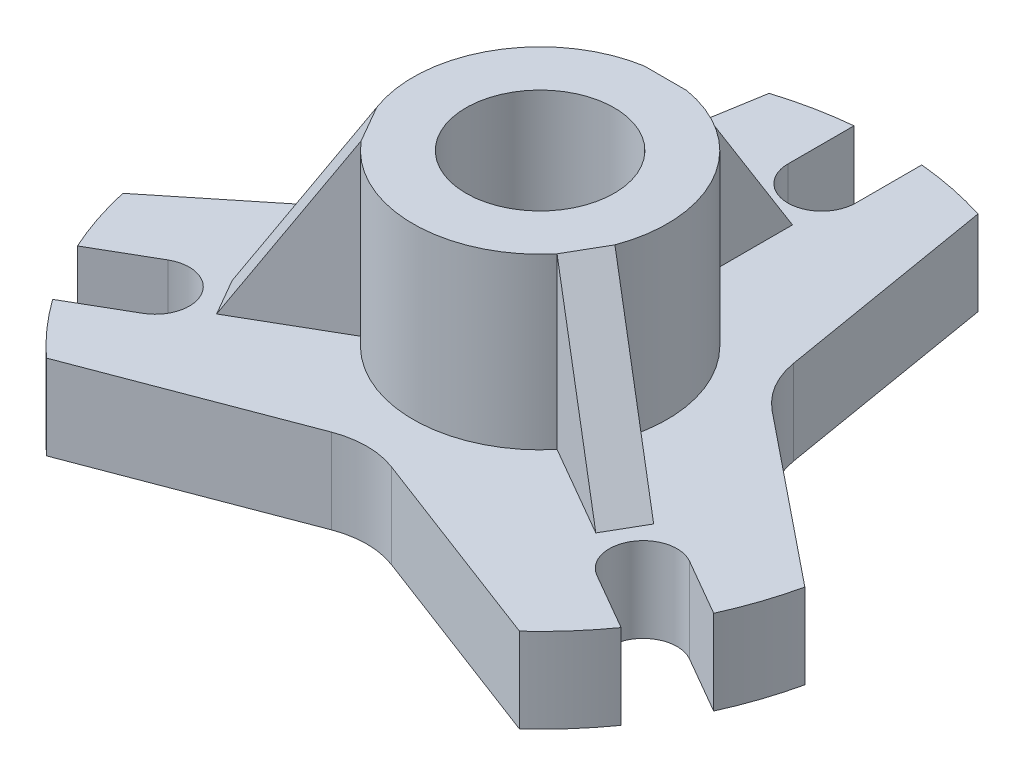
ISO-10303-21;
HEADER;
FILE_DESCRIPTION(('STEP AP214'),'2;1');
FILE_NAME('part.step','',(''),(''),'','','');
FILE_SCHEMA(('AUTOMOTIVE_DESIGN { 1 0 10303 214 1 1 1 1 }'));
ENDSEC;
DATA;
#1=APPLICATION_CONTEXT('core data for automotive mechanical design processes');
#2=APPLICATION_PROTOCOL_DEFINITION('international standard','automotive_design',2000,#1);
#3=PRODUCT_CONTEXT('',#1,'mechanical');
#4=PRODUCT('Part','Part','',(#3));
#5=PRODUCT_RELATED_PRODUCT_CATEGORY('part','',(#4));
#6=PRODUCT_DEFINITION_FORMATION('','',#4);
#7=PRODUCT_DEFINITION_CONTEXT('part definition',#1,'design');
#8=PRODUCT_DEFINITION('design','',#6,#7);
#9=PRODUCT_DEFINITION_SHAPE('','',#8);
#10=(LENGTH_UNIT() NAMED_UNIT(*) SI_UNIT(.MILLI.,.METRE.));
#11=(NAMED_UNIT(*) PLANE_ANGLE_UNIT() SI_UNIT($,.RADIAN.));
#12=(NAMED_UNIT(*) SI_UNIT($,.STERADIAN.) SOLID_ANGLE_UNIT());
#13=UNCERTAINTY_MEASURE_WITH_UNIT(LENGTH_MEASURE(1.E-05),#10,'distance_accuracy_value','');
#14=(GEOMETRIC_REPRESENTATION_CONTEXT(3) GLOBAL_UNCERTAINTY_ASSIGNED_CONTEXT((#13)) GLOBAL_UNIT_ASSIGNED_CONTEXT((#10,
#11,#12)) REPRESENTATION_CONTEXT('',''));
#15=CARTESIAN_POINT('',(0.,0.,0.));
#16=DIRECTION('',(0.,0.,1.));
#17=DIRECTION('',(1.,0.,0.));
#18=AXIS2_PLACEMENT_3D('',#15,#16,#17);
#19=CARTESIAN_POINT('',(0.,20.,0.));
#20=DIRECTION('',(0.,-1.,0.));
#21=DIRECTION('',(0.,0.,-1.));
#22=AXIS2_PLACEMENT_3D('',#19,#20,#21);
#23=CYLINDRICAL_SURFACE('',#22,82.5);
#24=CARTESIAN_POINT('',(0.,0.,0.));
#25=DIRECTION('',(0.,1.,0.));
#26=DIRECTION('',(0.,0.,1.));
#27=AXIS2_PLACEMENT_3D('',#24,#25,#26);
#28=CIRCLE('',#27,82.5);
#29=CARTESIAN_POINT('',(-67.1103895362694,0.,47.9838057712202));
#30=VERTEX_POINT('',#29);
#31=CARTESIAN_POINT('',(-55.8506507132066,0.,60.7202998585432));
#32=VERTEX_POINT('',#31);
#33=EDGE_CURVE('E278',#30,#32,#28,.T.);
#34=ORIENTED_EDGE('',*,*,#33,.T.);
#35=DIRECTION('',(0.,1.,0.));
#36=VECTOR('',#35,1.);
#37=CARTESIAN_POINT('',(-55.8506507132066,0.,60.7202998585432));
#38=LINE('',#37,#36);
#39=CARTESIAN_POINT('',(-55.8506507132066,20.,60.7202998585432));
#40=VERTEX_POINT('',#39);
#41=EDGE_CURVE('E344',#32,#40,#38,.T.);
#42=ORIENTED_EDGE('',*,*,#41,.T.);
#43=CARTESIAN_POINT('',(0.,20.,0.));
#44=DIRECTION('',(0.,1.,0.));
#45=DIRECTION('',(0.,0.,1.));
#46=AXIS2_PLACEMENT_3D('',#43,#44,#45);
#47=CIRCLE('',#46,82.5);
#48=CARTESIAN_POINT('',(-67.1103895362694,20.,47.9838057712202));
#49=VERTEX_POINT('',#48);
#50=EDGE_CURVE('E319',#49,#40,#47,.T.);
#51=ORIENTED_EDGE('',*,*,#50,.F.);
#52=DIRECTION('',(0.,1.,0.));
#53=VECTOR('',#52,1.);
#54=CARTESIAN_POINT('',(-67.1103895362694,0.,47.9838057712202));
#55=LINE('',#54,#53);
#56=EDGE_CURVE('E341',#30,#49,#55,.T.);
#57=ORIENTED_EDGE('',*,*,#56,.F.);
#58=EDGE_LOOP('',(#34,#42,#51,#57));
#59=FACE_BOUND('',#58,.T.);
#60=ADVANCED_FACE('F36',(#59),#23,.T.);
#61=CARTESIAN_POINT('',(75.1103895362699,0.,34.1273993106682));
#62=VERTEX_POINT('',#61);
#63=CARTESIAN_POINT('',(80.5104687658674,0.,18.0087317460251));
#64=VERTEX_POINT('',#63);
#65=EDGE_CURVE('E272',#62,#64,#28,.T.);
#66=ORIENTED_EDGE('',*,*,#65,.T.);
#67=DIRECTION('',(0.,1.,0.));
#68=VECTOR('',#67,1.);
#69=CARTESIAN_POINT('',(80.5104687658674,0.,18.0087317460251));
#70=LINE('',#69,#68);
#71=CARTESIAN_POINT('',(80.5104687658674,20.,18.0087317460251));
#72=VERTEX_POINT('',#71);
#73=EDGE_CURVE('E264',#64,#72,#70,.T.);
#74=ORIENTED_EDGE('',*,*,#73,.T.);
#75=CARTESIAN_POINT('',(75.1103895362699,20.,34.1273993106682));
#76=VERTEX_POINT('',#75);
#77=EDGE_CURVE('E313',#76,#72,#47,.T.);
#78=ORIENTED_EDGE('',*,*,#77,.F.);
#79=DIRECTION('',(0.,1.,0.));
#80=VECTOR('',#79,1.);
#81=CARTESIAN_POINT('',(75.1103895362699,0.,34.1273993106682));
#82=LINE('',#81,#80);
#83=EDGE_CURVE('E414',#62,#76,#82,.T.);
#84=ORIENTED_EDGE('',*,*,#83,.F.);
#85=EDGE_LOOP('',(#66,#74,#78,#84));
#86=FACE_BOUND('',#85,.T.);
#87=ADVANCED_FACE('F525',(#86),#23,.T.);
#88=CARTESIAN_POINT('',(-8.,0.,-82.1112050818888));
#89=VERTEX_POINT('',#88);
#90=CARTESIAN_POINT('',(-24.6598177954314,0.,-78.7282883485734));
#91=VERTEX_POINT('',#90);
#92=EDGE_CURVE('E283',#89,#91,#28,.T.);
#93=ORIENTED_EDGE('',*,*,#92,.T.);
#94=DIRECTION('',(0.,1.,0.));
#95=VECTOR('',#94,1.);
#96=CARTESIAN_POINT('',(-24.6598177954314,0.,-78.7282883485734));
#97=LINE('',#96,#95);
#98=CARTESIAN_POINT('',(-24.6598177954314,20.,-78.7282883485734));
#99=VERTEX_POINT('',#98);
#100=EDGE_CURVE('E367',#91,#99,#97,.T.);
#101=ORIENTED_EDGE('',*,*,#100,.T.);
#102=CARTESIAN_POINT('',(-8.,20.,-82.1112050818888));
#103=VERTEX_POINT('',#102);
#104=EDGE_CURVE('E315',#103,#99,#47,.T.);
#105=ORIENTED_EDGE('',*,*,#104,.F.);
#106=DIRECTION('',(0.,1.,0.));
#107=VECTOR('',#106,1.);
#108=CARTESIAN_POINT('',(-8.,0.,-82.1112050818888));
#109=LINE('',#108,#107);
#110=EDGE_CURVE('E434',#89,#103,#109,.T.);
#111=ORIENTED_EDGE('',*,*,#110,.F.);
#112=EDGE_LOOP('',(#93,#101,#105,#111));
#113=FACE_BOUND('',#112,.T.);
#114=ADVANCED_FACE('F531',(#113),#23,.T.);
#115=CARTESIAN_POINT('',(55.8506507132066,20.,60.7202998585432));
#116=VERTEX_POINT('',#115);
#117=CARTESIAN_POINT('',(67.11038953627,20.,47.9838057712193));
#118=VERTEX_POINT('',#117);
#119=EDGE_CURVE('E314',#116,#118,#47,.T.);
#120=ORIENTED_EDGE('',*,*,#119,.F.);
#121=DIRECTION('',(0.,1.,0.));
#122=VECTOR('',#121,1.);
#123=CARTESIAN_POINT('',(55.8506507132066,0.,60.7202998585432));
#124=LINE('',#123,#122);
#125=CARTESIAN_POINT('',(55.8506507132066,0.,60.7202998585432));
#126=VERTEX_POINT('',#125);
#127=EDGE_CURVE('E348',#126,#116,#124,.T.);
#128=ORIENTED_EDGE('',*,*,#127,.F.);
#129=CARTESIAN_POINT('',(67.11038953627,0.,47.9838057712193));
#130=VERTEX_POINT('',#129);
#131=EDGE_CURVE('E276',#126,#130,#28,.T.);
#132=ORIENTED_EDGE('',*,*,#131,.T.);
#133=DIRECTION('',(0.,1.,0.));
#134=VECTOR('',#133,1.);
#135=CARTESIAN_POINT('',(67.11038953627,0.,47.9838057712193));
#136=LINE('',#135,#134);
#137=EDGE_CURVE('E416',#130,#118,#136,.T.);
#138=ORIENTED_EDGE('',*,*,#137,.T.);
#139=EDGE_LOOP('',(#120,#128,#132,#138));
#140=FACE_BOUND('',#139,.T.);
#141=ADVANCED_FACE('F543',(#140),#23,.T.);
#142=CARTESIAN_POINT('',(24.6598177954314,20.,-78.7282883485734));
#143=VERTEX_POINT('',#142);
#144=CARTESIAN_POINT('',(8.,20.,-82.1112050818888));
#145=VERTEX_POINT('',#144);
#146=EDGE_CURVE('E263',#143,#145,#47,.T.);
#147=ORIENTED_EDGE('',*,*,#146,.F.);
#148=DIRECTION('',(0.,1.,0.));
#149=VECTOR('',#148,1.);
#150=CARTESIAN_POINT('',(24.6598177954314,0.,-78.7282883485734));
#151=LINE('',#150,#149);
#152=CARTESIAN_POINT('',(24.6598177954314,0.,-78.7282883485734));
#153=VERTEX_POINT('',#152);
#154=EDGE_CURVE('E250',#153,#143,#151,.T.);
#155=ORIENTED_EDGE('',*,*,#154,.F.);
#156=CARTESIAN_POINT('',(8.,0.,-82.1112050818888));
#157=VERTEX_POINT('',#156);
#158=EDGE_CURVE('E261',#153,#157,#28,.T.);
#159=ORIENTED_EDGE('',*,*,#158,.T.);
#160=DIRECTION('',(0.,1.,0.));
#161=VECTOR('',#160,1.);
#162=CARTESIAN_POINT('',(8.,0.,-82.1112050818888));
#163=LINE('',#162,#161);
#164=EDGE_CURVE('E436',#157,#145,#163,.T.);
#165=ORIENTED_EDGE('',*,*,#164,.T.);
#166=EDGE_LOOP('',(#147,#155,#159,#165));
#167=FACE_BOUND('',#166,.T.);
#168=ADVANCED_FACE('F259',(#167),#23,.T.);
#169=CARTESIAN_POINT('',(0.,20.,0.));
#170=DIRECTION('',(0.,1.,0.));
#171=DIRECTION('',(0.,0.,1.));
#172=AXIS2_PLACEMENT_3D('',#169,#170,#171);
#173=PLANE('',#172);
#174=DIRECTION('',(-0.934941380118152,0.,0.354802220600104));
#175=VECTOR('',#174,1.);
#176=CARTESIAN_POINT('',(-55.8506507132066,20.,60.7202998585432));
#177=LINE('',#176,#175);
#178=CARTESIAN_POINT('',(-7.09604441200207,20.,42.2183456740304));
#179=VERTEX_POINT('',#178);
#180=EDGE_CURVE('E334',#179,#40,#177,.T.);
#181=ORIENTED_EDGE('',*,*,#180,.F.);
#182=CARTESIAN_POINT('',(0.,20.,60.9171732763935));
#183=DIRECTION('',(0.,1.,0.));
#184=DIRECTION('',(0.,0.,1.));
#185=AXIS2_PLACEMENT_3D('',#182,#183,#184);
#186=CIRCLE('',#185,20.);
#187=CARTESIAN_POINT('',(7.09604441200209,20.,42.2183456740304));
#188=VERTEX_POINT('',#187);
#189=EDGE_CURVE('E598',#179,#188,#186,.F.);
#190=ORIENTED_EDGE('',*,*,#189,.T.);
#191=DIRECTION('',(-0.934941380118152,0.,-0.354802220600104));
#192=VECTOR('',#191,1.);
#193=CARTESIAN_POINT('',(0.,20.,39.5254577899396));
#194=LINE('',#193,#192);
#195=EDGE_CURVE('E556',#116,#188,#194,.T.);
#196=ORIENTED_EDGE('',*,*,#195,.F.);
#197=ORIENTED_EDGE('',*,*,#119,.T.);
#198=DIRECTION('',(0.866025403784443,0.,0.499999999999992));
#199=VECTOR('',#198,1.);
#200=CARTESIAN_POINT('',(-3.99999999999994,20.,6.92820323027555));
#201=LINE('',#200,#199);
#202=CARTESIAN_POINT('',(53.5906893516655,20.,40.178203230275));
#203=VERTEX_POINT('',#202);
#204=EDGE_CURVE('E408',#203,#118,#201,.T.);
#205=ORIENTED_EDGE('',*,*,#204,.F.);
#206=CARTESIAN_POINT('',(57.5906893516655,20.,33.2499999999995));
#207=DIRECTION('',(0.,1.,0.));
#208=DIRECTION('',(-0.866025403784443,0.,-0.499999999999992));
#209=AXIS2_PLACEMENT_3D('',#206,#207,#208);
#210=CIRCLE('',#209,8.);
#211=CARTESIAN_POINT('',(61.5906893516654,20.,26.3217967697239));
#212=VERTEX_POINT('',#211);
#213=EDGE_CURVE('E369',#212,#203,#210,.T.);
#214=ORIENTED_EDGE('',*,*,#213,.F.);
#215=DIRECTION('',(0.866025403784443,0.,0.499999999999992));
#216=VECTOR('',#215,1.);
#217=CARTESIAN_POINT('',(3.99999999999994,20.,-6.92820323027555));
#218=LINE('',#217,#216);
#219=EDGE_CURVE('E400',#212,#76,#218,.T.);
#220=ORIENTED_EDGE('',*,*,#219,.T.);
#221=ORIENTED_EDGE('',*,*,#77,.T.);
#222=DIRECTION('',(0.778334472275941,0.,0.627849862042617));
#223=VECTOR('',#222,1.);
#224=CARTESIAN_POINT('',(34.6812339169926,20.,-18.9597950278777));
#225=LINE('',#224,#223);
#226=CARTESIAN_POINT('',(40.5929188749437,20.,-14.1910860505718));
#227=VERTEX_POINT('',#226);
#228=EDGE_CURVE('E255',#227,#72,#225,.T.);
#229=ORIENTED_EDGE('',*,*,#228,.F.);
#230=CARTESIAN_POINT('',(53.149916115796,20.,-29.7577754960906));
#231=DIRECTION('',(0.,1.,0.));
#232=DIRECTION('',(0.,0.,1.));
#233=AXIS2_PLACEMENT_3D('',#230,#231,#232);
#234=CIRCLE('',#233,20.);
#235=CARTESIAN_POINT('',(33.4252580596994,20.,-26.4505312399065));
#236=VERTEX_POINT('',#235);
#237=EDGE_CURVE('E44',#227,#236,#234,.F.);
#238=ORIENTED_EDGE('',*,*,#237,.T.);
#239=DIRECTION('',(0.165362212809206,0.,0.986232902804831));
#240=VECTOR('',#239,1.);
#241=CARTESIAN_POINT('',(24.6598177954314,20.,-78.7282883485734));
#242=LINE('',#241,#240);
#243=EDGE_CURVE('E347',#143,#236,#242,.T.);
#244=ORIENTED_EDGE('',*,*,#243,.F.);
#245=ORIENTED_EDGE('',*,*,#146,.T.);
#246=DIRECTION('',(0.,0.,-1.));
#247=VECTOR('',#246,1.);
#248=CARTESIAN_POINT('',(8.,20.,0.));
#249=LINE('',#248,#247);
#250=CARTESIAN_POINT('',(8.,20.,-66.5));
#251=VERTEX_POINT('',#250);
#252=EDGE_CURVE('E428',#251,#145,#249,.T.);
#253=ORIENTED_EDGE('',*,*,#252,.F.);
#254=CARTESIAN_POINT('',(0.,20.,-66.5));
#255=DIRECTION('',(0.,1.,0.));
#256=DIRECTION('',(0.,0.,1.));
#257=AXIS2_PLACEMENT_3D('',#254,#255,#256);
#258=CIRCLE('',#257,8.);
#259=CARTESIAN_POINT('',(-8.,20.,-66.5));
#260=VERTEX_POINT('',#259);
#261=EDGE_CURVE('E390',#260,#251,#258,.T.);
#262=ORIENTED_EDGE('',*,*,#261,.F.);
#263=DIRECTION('',(0.,0.,-1.));
#264=VECTOR('',#263,1.);
#265=CARTESIAN_POINT('',(-8.,20.,0.));
#266=LINE('',#265,#264);
#267=EDGE_CURVE('E421',#260,#103,#266,.T.);
#268=ORIENTED_EDGE('',*,*,#267,.T.);
#269=ORIENTED_EDGE('',*,*,#104,.T.);
#270=DIRECTION('',(0.165362212809205,0.,-0.986232902804831));
#271=VECTOR('',#270,1.);
#272=CARTESIAN_POINT('',(-34.6812339169926,20.,-18.9597950278777));
#273=LINE('',#272,#271);
#274=CARTESIAN_POINT('',(-33.4252580596994,20.,-26.4505312399065));
#275=VERTEX_POINT('',#274);
#276=EDGE_CURVE('E360',#275,#99,#273,.T.);
#277=ORIENTED_EDGE('',*,*,#276,.F.);
#278=CARTESIAN_POINT('',(-53.149916115796,20.,-29.7577754960906));
#279=DIRECTION('',(0.,1.,0.));
#280=DIRECTION('',(0.,0.,1.));
#281=AXIS2_PLACEMENT_3D('',#278,#279,#280);
#282=CIRCLE('',#281,20.);
#283=CARTESIAN_POINT('',(-40.5929188749437,20.,-14.1910860505718));
#284=VERTEX_POINT('',#283);
#285=EDGE_CURVE('E594',#275,#284,#282,.F.);
#286=ORIENTED_EDGE('',*,*,#285,.T.);
#287=DIRECTION('',(0.778334472275941,0.,-0.627849862042617));
#288=VECTOR('',#287,1.);
#289=CARTESIAN_POINT('',(-80.5104687658674,20.,18.0087317460251));
#290=LINE('',#289,#288);
#291=CARTESIAN_POINT('',(-80.5104687658674,20.,18.0087317460251));
#292=VERTEX_POINT('',#291);
#293=EDGE_CURVE('E363',#292,#284,#290,.T.);
#294=ORIENTED_EDGE('',*,*,#293,.F.);
#295=CARTESIAN_POINT('',(-75.1103895362695,20.,34.1273993106692));
#296=VERTEX_POINT('',#295);
#297=EDGE_CURVE('E320',#292,#296,#47,.T.);
#298=ORIENTED_EDGE('',*,*,#297,.T.);
#299=DIRECTION('',(-0.866025403784436,0.,0.500000000000004));
#300=VECTOR('',#299,1.);
#301=CARTESIAN_POINT('',(-4.00000000000003,20.,-6.92820323027549));
#302=LINE('',#301,#300);
#303=CARTESIAN_POINT('',(-61.5906893516651,20.,26.3217967697248));
#304=VERTEX_POINT('',#303);
#305=EDGE_CURVE('E383',#304,#296,#302,.T.);
#306=ORIENTED_EDGE('',*,*,#305,.F.);
#307=CARTESIAN_POINT('',(-57.590689351665,20.,33.2500000000003));
#308=DIRECTION('',(0.,1.,0.));
#309=DIRECTION('',(0.866025403784436,0.,-0.500000000000004));
#310=AXIS2_PLACEMENT_3D('',#307,#308,#309);
#311=CIRCLE('',#310,8.);
#312=CARTESIAN_POINT('',(-53.590689351665,20.,40.1782032302758));
#313=VERTEX_POINT('',#312);
#314=EDGE_CURVE('E380',#313,#304,#311,.T.);
#315=ORIENTED_EDGE('',*,*,#314,.F.);
#316=DIRECTION('',(-0.866025403784436,0.,0.500000000000004));
#317=VECTOR('',#316,1.);
#318=CARTESIAN_POINT('',(4.00000000000003,20.,6.92820323027549));
#319=LINE('',#318,#317);
#320=EDGE_CURVE('E337',#313,#49,#319,.T.);
#321=ORIENTED_EDGE('',*,*,#320,.T.);
#322=ORIENTED_EDGE('',*,*,#50,.T.);
#323=EDGE_LOOP('',(#181,#190,#196,#197,#205,#214,#220,#221,#229,#238,#244,#245,#253,#262,#268,
#269,#277,#286,#294,#298,#306,#315,#321,#322));
#324=FACE_BOUND('',#323,.T.);
#325=DIRECTION('',(0.866025403784443,0.,0.499999999999992));
#326=VECTOR('',#325,1.);
#327=CARTESIAN_POINT('',(12.6554445662278,20.,13.0801270189221));
#328=LINE('',#327,#326);
#329=CARTESIAN_POINT('',(23.1173769148992,20.,19.120326476671));
#330=VERTEX_POINT('',#329);
#331=CARTESIAN_POINT('',(44.7680120095103,20.,31.6203264766708));
#332=VERTEX_POINT('',#331);
#333=EDGE_CURVE('E469',#330,#332,#328,.T.);
#334=ORIENTED_EDGE('',*,*,#333,.F.);
#335=CARTESIAN_POINT('',(0.,20.,0.));
#336=DIRECTION('',(0.,1.,0.));
#337=DIRECTION('',(0.,0.,1.));
#338=AXIS2_PLACEMENT_3D('',#335,#336,#337);
#339=CIRCLE('',#338,30.);
#340=CARTESIAN_POINT('',(-23.1173769148989,20.,19.1203264766713));
#341=VERTEX_POINT('',#340);
#342=EDGE_CURVE('E298',#341,#330,#339,.T.);
#343=ORIENTED_EDGE('',*,*,#342,.F.);
#344=DIRECTION('',(-0.866025403784436,0.,0.500000000000004));
#345=VECTOR('',#344,1.);
#346=CARTESIAN_POINT('',(-12.6554445662276,20.,13.0801270189223));
#347=LINE('',#346,#345);
#348=CARTESIAN_POINT('',(-44.7680120095098,20.,31.6203264766714));
#349=VERTEX_POINT('',#348);
#350=EDGE_CURVE('E480',#341,#349,#347,.T.);
#351=ORIENTED_EDGE('',*,*,#350,.T.);
#352=DIRECTION('',(-0.500000000000004,0.,-0.866025403784436));
#353=VECTOR('',#352,1.);
#354=CARTESIAN_POINT('',(-44.7680120095098,20.,31.6203264766714));
#355=LINE('',#354,#353);
#356=CARTESIAN_POINT('',(-49.7680120095099,20.,22.9600724388271));
#357=VERTEX_POINT('',#356);
#358=EDGE_CURVE('E447',#349,#357,#355,.T.);
#359=ORIENTED_EDGE('',*,*,#358,.T.);
#360=DIRECTION('',(-0.866025403784436,0.,0.500000000000004));
#361=VECTOR('',#360,1.);
#362=CARTESIAN_POINT('',(-17.6554445662277,20.,4.41987298107789));
#363=LINE('',#362,#361);
#364=CARTESIAN_POINT('',(-28.1173769148989,20.,10.460072438827));
#365=VERTEX_POINT('',#364);
#366=EDGE_CURVE('E481',#365,#357,#363,.T.);
#367=ORIENTED_EDGE('',*,*,#366,.F.);
#368=CARTESIAN_POINT('',(-5.,20.,-29.5803989154981));
#369=VERTEX_POINT('',#368);
#370=EDGE_CURVE('E300',#369,#365,#339,.T.);
#371=ORIENTED_EDGE('',*,*,#370,.F.);
#372=DIRECTION('',(0.,0.,-1.));
#373=VECTOR('',#372,1.);
#374=CARTESIAN_POINT('',(-5.,20.,-17.5));
#375=LINE('',#374,#373);
#376=CARTESIAN_POINT('',(-5.,20.,-54.5803989154981));
#377=VERTEX_POINT('',#376);
#378=EDGE_CURVE('E491',#369,#377,#375,.T.);
#379=ORIENTED_EDGE('',*,*,#378,.T.);
#380=DIRECTION('',(1.,0.,0.));
#381=VECTOR('',#380,1.);
#382=CARTESIAN_POINT('',(-5.,20.,-54.5803989154981));
#383=LINE('',#382,#381);
#384=CARTESIAN_POINT('',(5.,20.,-54.5803989154981));
#385=VERTEX_POINT('',#384);
#386=EDGE_CURVE('E465',#377,#385,#383,.T.);
#387=ORIENTED_EDGE('',*,*,#386,.T.);
#388=DIRECTION('',(0.,0.,-1.));
#389=VECTOR('',#388,1.);
#390=CARTESIAN_POINT('',(5.,20.,-17.5));
#391=LINE('',#390,#389);
#392=CARTESIAN_POINT('',(5.,20.,-29.5803989154981));
#393=VERTEX_POINT('',#392);
#394=EDGE_CURVE('E492',#393,#385,#391,.T.);
#395=ORIENTED_EDGE('',*,*,#394,.F.);
#396=CARTESIAN_POINT('',(28.1173769148991,20.,10.4600724388266));
#397=VERTEX_POINT('',#396);
#398=EDGE_CURVE('E293',#397,#393,#339,.T.);
#399=ORIENTED_EDGE('',*,*,#398,.F.);
#400=DIRECTION('',(0.866025403784443,0.,0.499999999999992));
#401=VECTOR('',#400,1.);
#402=CARTESIAN_POINT('',(17.6554445662277,20.,4.41987298107764));
#403=LINE('',#402,#401);
#404=CARTESIAN_POINT('',(49.7680120095102,20.,22.9600724388264));
#405=VERTEX_POINT('',#404);
#406=EDGE_CURVE('E467',#397,#405,#403,.T.);
#407=ORIENTED_EDGE('',*,*,#406,.T.);
#408=DIRECTION('',(-0.499999999999992,0.,0.866025403784443));
#409=VECTOR('',#408,1.);
#410=CARTESIAN_POINT('',(49.7680120095102,20.,22.9600724388264));
#411=LINE('',#410,#409);
#412=EDGE_CURVE('E446',#405,#332,#411,.T.);
#413=ORIENTED_EDGE('',*,*,#412,.T.);
#414=EDGE_LOOP('',(#334,#343,#351,#359,#367,#371,#379,#387,#395,#399,#407,#413));
#415=FACE_BOUND('',#414,.T.);
#416=ADVANCED_FACE('F332',(#324,#415),#173,.T.);
#417=CARTESIAN_POINT('',(0.,0.,0.));
#418=DIRECTION('',(0.,1.,0.));
#419=DIRECTION('',(0.,0.,1.));
#420=AXIS2_PLACEMENT_3D('',#417,#418,#419);
#421=PLANE('',#420);
#422=CARTESIAN_POINT('',(0.,0.,0.));
#423=DIRECTION('',(0.,1.,0.));
#424=DIRECTION('',(0.,0.,1.));
#425=AXIS2_PLACEMENT_3D('',#422,#423,#424);
#426=CIRCLE('',#425,17.5);
#427=CARTESIAN_POINT('',(0.,0.,17.5));
#428=VERTEX_POINT('',#427);
#429=EDGE_CURVE('E502',#428,#428,#426,.T.);
#430=ORIENTED_EDGE('',*,*,#429,.T.);
#431=EDGE_LOOP('',(#430));
#432=FACE_BOUND('',#431,.T.);
#433=DIRECTION('',(-0.934941380118152,0.,-0.354802220600104));
#434=VECTOR('',#433,1.);
#435=CARTESIAN_POINT('',(0.,0.,39.5254577899396));
#436=LINE('',#435,#434);
#437=CARTESIAN_POINT('',(7.09604441200209,0.,42.2183456740304));
#438=VERTEX_POINT('',#437);
#439=EDGE_CURVE('E575',#126,#438,#436,.T.);
#440=ORIENTED_EDGE('',*,*,#439,.T.);
#441=CARTESIAN_POINT('',(0.,0.,60.9171732763935));
#442=DIRECTION('',(0.,1.,0.));
#443=DIRECTION('',(0.,0.,1.));
#444=AXIS2_PLACEMENT_3D('',#441,#442,#443);
#445=CIRCLE('',#444,20.);
#446=CARTESIAN_POINT('',(-7.09604441200207,0.,42.2183456740304));
#447=VERTEX_POINT('',#446);
#448=EDGE_CURVE('E600',#438,#447,#445,.T.);
#449=ORIENTED_EDGE('',*,*,#448,.T.);
#450=DIRECTION('',(-0.934941380118152,0.,0.354802220600104));
#451=VECTOR('',#450,1.);
#452=CARTESIAN_POINT('',(-55.8506507132066,0.,60.7202998585432));
#453=LINE('',#452,#451);
#454=EDGE_CURVE('E351',#447,#32,#453,.T.);
#455=ORIENTED_EDGE('',*,*,#454,.T.);
#456=ORIENTED_EDGE('',*,*,#33,.F.);
#457=DIRECTION('',(-0.866025403784436,0.,0.500000000000004));
#458=VECTOR('',#457,1.);
#459=CARTESIAN_POINT('',(4.00000000000003,0.,6.92820323027549));
#460=LINE('',#459,#458);
#461=CARTESIAN_POINT('',(-53.590689351665,0.,40.1782032302758));
#462=VERTEX_POINT('',#461);
#463=EDGE_CURVE('E377',#462,#30,#460,.T.);
#464=ORIENTED_EDGE('',*,*,#463,.F.);
#465=CARTESIAN_POINT('',(-57.590689351665,0.,33.2500000000003));
#466=DIRECTION('',(0.,1.,0.));
#467=DIRECTION('',(0.866025403784436,0.,-0.500000000000004));
#468=AXIS2_PLACEMENT_3D('',#465,#466,#467);
#469=CIRCLE('',#468,8.);
#470=CARTESIAN_POINT('',(-61.5906893516651,0.,26.3217967697248));
#471=VERTEX_POINT('',#470);
#472=EDGE_CURVE('E371',#462,#471,#469,.T.);
#473=ORIENTED_EDGE('',*,*,#472,.T.);
#474=DIRECTION('',(-0.866025403784436,0.,0.500000000000004));
#475=VECTOR('',#474,1.);
#476=CARTESIAN_POINT('',(-4.00000000000003,0.,-6.92820323027549));
#477=LINE('',#476,#475);
#478=CARTESIAN_POINT('',(-75.1103895362695,0.,34.1273993106692));
#479=VERTEX_POINT('',#478);
#480=EDGE_CURVE('E374',#471,#479,#477,.T.);
#481=ORIENTED_EDGE('',*,*,#480,.T.);
#482=CARTESIAN_POINT('',(-80.5104687658674,0.,18.0087317460251));
#483=VERTEX_POINT('',#482);
#484=EDGE_CURVE('E275',#483,#479,#28,.T.);
#485=ORIENTED_EDGE('',*,*,#484,.F.);
#486=DIRECTION('',(0.778334472275941,0.,-0.627849862042617));
#487=VECTOR('',#486,1.);
#488=CARTESIAN_POINT('',(-80.5104687658674,0.,18.0087317460251));
#489=LINE('',#488,#487);
#490=CARTESIAN_POINT('',(-40.5929188749437,0.,-14.1910860505718));
#491=VERTEX_POINT('',#490);
#492=EDGE_CURVE('E356',#483,#491,#489,.T.);
#493=ORIENTED_EDGE('',*,*,#492,.T.);
#494=CARTESIAN_POINT('',(-53.149916115796,0.,-29.7577754960906));
#495=DIRECTION('',(0.,1.,0.));
#496=DIRECTION('',(0.,0.,1.));
#497=AXIS2_PLACEMENT_3D('',#494,#495,#496);
#498=CIRCLE('',#497,20.);
#499=CARTESIAN_POINT('',(-33.4252580596994,0.,-26.4505312399065));
#500=VERTEX_POINT('',#499);
#501=EDGE_CURVE('E596',#491,#500,#498,.T.);
#502=ORIENTED_EDGE('',*,*,#501,.T.);
#503=DIRECTION('',(0.165362212809205,0.,-0.986232902804831));
#504=VECTOR('',#503,1.);
#505=CARTESIAN_POINT('',(-34.6812339169926,0.,-18.9597950278777));
#506=LINE('',#505,#504);
#507=EDGE_CURVE('E359',#500,#91,#506,.T.);
#508=ORIENTED_EDGE('',*,*,#507,.T.);
#509=ORIENTED_EDGE('',*,*,#92,.F.);
#510=DIRECTION('',(0.,0.,-1.));
#511=VECTOR('',#510,1.);
#512=CARTESIAN_POINT('',(-8.,0.,0.));
#513=LINE('',#512,#511);
#514=CARTESIAN_POINT('',(-8.,0.,-66.5));
#515=VERTEX_POINT('',#514);
#516=EDGE_CURVE('E423',#515,#89,#513,.T.);
#517=ORIENTED_EDGE('',*,*,#516,.F.);
#518=CARTESIAN_POINT('',(0.,0.,-66.5));
#519=DIRECTION('',(0.,1.,0.));
#520=DIRECTION('',(0.,0.,1.));
#521=AXIS2_PLACEMENT_3D('',#518,#519,#520);
#522=CIRCLE('',#521,8.);
#523=CARTESIAN_POINT('',(8.,0.,-66.5));
#524=VERTEX_POINT('',#523);
#525=EDGE_CURVE('E419',#515,#524,#522,.T.);
#526=ORIENTED_EDGE('',*,*,#525,.T.);
#527=DIRECTION('',(0.,0.,-1.));
#528=VECTOR('',#527,1.);
#529=CARTESIAN_POINT('',(8.,0.,0.));
#530=LINE('',#529,#528);
#531=EDGE_CURVE('E271',#524,#157,#530,.T.);
#532=ORIENTED_EDGE('',*,*,#531,.T.);
#533=ORIENTED_EDGE('',*,*,#158,.F.);
#534=DIRECTION('',(0.165362212809206,0.,0.986232902804831));
#535=VECTOR('',#534,1.);
#536=CARTESIAN_POINT('',(24.6598177954314,0.,-78.7282883485734));
#537=LINE('',#536,#535);
#538=CARTESIAN_POINT('',(33.4252580596994,0.,-26.4505312399065));
#539=VERTEX_POINT('',#538);
#540=EDGE_CURVE('E247',#153,#539,#537,.T.);
#541=ORIENTED_EDGE('',*,*,#540,.T.);
#542=CARTESIAN_POINT('',(53.149916115796,0.,-29.7577754960906));
#543=DIRECTION('',(0.,1.,0.));
#544=DIRECTION('',(0.,0.,1.));
#545=AXIS2_PLACEMENT_3D('',#542,#543,#544);
#546=CIRCLE('',#545,20.);
#547=CARTESIAN_POINT('',(40.5929188749437,0.,-14.1910860505718));
#548=VERTEX_POINT('',#547);
#549=EDGE_CURVE('E11',#539,#548,#546,.T.);
#550=ORIENTED_EDGE('',*,*,#549,.T.);
#551=DIRECTION('',(0.778334472275941,0.,0.627849862042617));
#552=VECTOR('',#551,1.);
#553=CARTESIAN_POINT('',(34.6812339169926,0.,-18.9597950278777));
#554=LINE('',#553,#552);
#555=EDGE_CURVE('E254',#548,#64,#554,.T.);
#556=ORIENTED_EDGE('',*,*,#555,.T.);
#557=ORIENTED_EDGE('',*,*,#65,.F.);
#558=DIRECTION('',(0.866025403784443,0.,0.499999999999992));
#559=VECTOR('',#558,1.);
#560=CARTESIAN_POINT('',(3.99999999999994,0.,-6.92820323027555));
#561=LINE('',#560,#559);
#562=CARTESIAN_POINT('',(61.5906893516654,0.,26.3217967697239));
#563=VERTEX_POINT('',#562);
#564=EDGE_CURVE('E403',#563,#62,#561,.T.);
#565=ORIENTED_EDGE('',*,*,#564,.F.);
#566=CARTESIAN_POINT('',(57.5906893516655,0.,33.2499999999995));
#567=DIRECTION('',(0.,1.,0.));
#568=DIRECTION('',(-0.866025403784443,0.,-0.499999999999992));
#569=AXIS2_PLACEMENT_3D('',#566,#567,#568);
#570=CIRCLE('',#569,8.);
#571=CARTESIAN_POINT('',(53.5906893516655,0.,40.178203230275));
#572=VERTEX_POINT('',#571);
#573=EDGE_CURVE('E396',#563,#572,#570,.T.);
#574=ORIENTED_EDGE('',*,*,#573,.T.);
#575=DIRECTION('',(0.866025403784443,0.,0.499999999999992));
#576=VECTOR('',#575,1.);
#577=CARTESIAN_POINT('',(-3.99999999999994,0.,6.92820323027555));
#578=LINE('',#577,#576);
#579=EDGE_CURVE('E399',#572,#130,#578,.T.);
#580=ORIENTED_EDGE('',*,*,#579,.T.);
#581=ORIENTED_EDGE('',*,*,#131,.F.);
#582=EDGE_LOOP('',(#440,#449,#455,#456,#464,#473,#481,#485,#493,#502,#508,#509,#517,#526,#532,
#533,#541,#550,#556,#557,#565,#574,#580,#581));
#583=FACE_BOUND('',#582,.T.);
#584=ADVANCED_FACE('F268',(#432,#583),#421,.F.);
#585=ORIENTED_EDGE('',*,*,#297,.F.);
#586=DIRECTION('',(0.,1.,0.));
#587=VECTOR('',#586,1.);
#588=CARTESIAN_POINT('',(-80.5104687658674,0.,18.0087317460251));
#589=LINE('',#588,#587);
#590=EDGE_CURVE('E362',#483,#292,#589,.T.);
#591=ORIENTED_EDGE('',*,*,#590,.F.);
#592=ORIENTED_EDGE('',*,*,#484,.T.);
#593=DIRECTION('',(0.,1.,0.));
#594=VECTOR('',#593,1.);
#595=CARTESIAN_POINT('',(-75.1103895362695,0.,34.1273993106692));
#596=LINE('',#595,#594);
#597=EDGE_CURVE('E392',#479,#296,#596,.T.);
#598=ORIENTED_EDGE('',*,*,#597,.T.);
#599=EDGE_LOOP('',(#585,#591,#592,#598));
#600=FACE_BOUND('',#599,.T.);
#601=ADVANCED_FACE('F527',(#600),#23,.T.);
#602=CARTESIAN_POINT('',(0.,60.,0.));
#603=DIRECTION('',(0.,-1.,0.));
#604=DIRECTION('',(0.,0.,-1.));
#605=AXIS2_PLACEMENT_3D('',#602,#603,#604);
#606=CYLINDRICAL_SURFACE('',#605,30.);
#607=DIRECTION('',(0.,-1.,0.));
#608=VECTOR('',#607,1.);
#609=CARTESIAN_POINT('',(28.1173769148991,60.,10.4600724388266));
#610=LINE('',#609,#608);
#611=CARTESIAN_POINT('',(28.1173769148991,60.,10.4600724388266));
#612=VERTEX_POINT('',#611);
#613=EDGE_CURVE('E472',#397,#612,#610,.F.);
#614=ORIENTED_EDGE('',*,*,#613,.F.);
#615=ORIENTED_EDGE('',*,*,#398,.T.);
#616=DIRECTION('',(0.,-1.,0.));
#617=VECTOR('',#616,1.);
#618=CARTESIAN_POINT('',(5.,60.,-29.5803989154981));
#619=LINE('',#618,#617);
#620=CARTESIAN_POINT('',(5.,60.,-29.5803989154981));
#621=VERTEX_POINT('',#620);
#622=EDGE_CURVE('E500',#393,#621,#619,.F.);
#623=ORIENTED_EDGE('',*,*,#622,.T.);
#624=CARTESIAN_POINT('',(0.,60.,0.));
#625=DIRECTION('',(0.,1.,0.));
#626=DIRECTION('',(0.,0.,1.));
#627=AXIS2_PLACEMENT_3D('',#624,#625,#626);
#628=CIRCLE('',#627,30.);
#629=EDGE_CURVE('E282',#612,#621,#628,.T.);
#630=ORIENTED_EDGE('',*,*,#629,.F.);
#631=EDGE_LOOP('',(#614,#615,#623,#630));
#632=FACE_BOUND('',#631,.T.);
#633=ADVANCED_FACE('F521',(#632),#606,.T.);
#634=ORIENTED_EDGE('',*,*,#342,.T.);
#635=DIRECTION('',(0.,-1.,0.));
#636=VECTOR('',#635,1.);
#637=CARTESIAN_POINT('',(23.1173769148992,60.,19.120326476671));
#638=LINE('',#637,#636);
#639=CARTESIAN_POINT('',(23.1173769148992,60.,19.120326476671));
#640=VERTEX_POINT('',#639);
#641=EDGE_CURVE('E477',#330,#640,#638,.F.);
#642=ORIENTED_EDGE('',*,*,#641,.T.);
#643=CARTESIAN_POINT('',(-23.1173769148989,60.,19.1203264766713));
#644=VERTEX_POINT('',#643);
#645=EDGE_CURVE('E280',#644,#640,#628,.T.);
#646=ORIENTED_EDGE('',*,*,#645,.F.);
#647=DIRECTION('',(0.,-1.,0.));
#648=VECTOR('',#647,1.);
#649=CARTESIAN_POINT('',(-23.1173769148989,60.,19.1203264766713));
#650=LINE('',#649,#648);
#651=EDGE_CURVE('E484',#341,#644,#650,.F.);
#652=ORIENTED_EDGE('',*,*,#651,.F.);
#653=EDGE_LOOP('',(#634,#642,#646,#652));
#654=FACE_BOUND('',#653,.T.);
#655=ADVANCED_FACE('F512',(#654),#606,.T.);
#656=CARTESIAN_POINT('',(0.,60.,0.));
#657=DIRECTION('',(0.,-1.,0.));
#658=DIRECTION('',(0.,0.,-1.));
#659=AXIS2_PLACEMENT_3D('',#656,#657,#658);
#660=CYLINDRICAL_SURFACE('',#659,17.5);
#661=CARTESIAN_POINT('',(0.,60.,0.));
#662=DIRECTION('',(0.,1.,0.));
#663=DIRECTION('',(0.,0.,1.));
#664=AXIS2_PLACEMENT_3D('',#661,#662,#663);
#665=CIRCLE('',#664,17.5);
#666=CARTESIAN_POINT('',(0.,60.,17.5));
#667=VERTEX_POINT('',#666);
#668=EDGE_CURVE('E503',#667,#667,#665,.T.);
#669=ORIENTED_EDGE('',*,*,#668,.T.);
#670=EDGE_LOOP('',(#669));
#671=FACE_BOUND('',#670,.T.);
#672=ORIENTED_EDGE('',*,*,#429,.F.);
#673=EDGE_LOOP('',(#672));
#674=FACE_BOUND('',#673,.T.);
#675=ADVANCED_FACE('F509',(#671,#674),#660,.F.);
#676=ORIENTED_EDGE('',*,*,#370,.T.);
#677=DIRECTION('',(0.,-1.,0.));
#678=VECTOR('',#677,1.);
#679=CARTESIAN_POINT('',(-28.1173769148989,60.,10.460072438827));
#680=LINE('',#679,#678);
#681=CARTESIAN_POINT('',(-28.117376914899,60.,10.460072438827));
#682=VERTEX_POINT('',#681);
#683=EDGE_CURVE('E489',#365,#682,#680,.F.);
#684=ORIENTED_EDGE('',*,*,#683,.T.);
#685=CARTESIAN_POINT('',(-5.,60.,-29.5803989154981));
#686=VERTEX_POINT('',#685);
#687=EDGE_CURVE('E273',#686,#682,#628,.T.);
#688=ORIENTED_EDGE('',*,*,#687,.F.);
#689=DIRECTION('',(0.,-1.,0.));
#690=VECTOR('',#689,1.);
#691=CARTESIAN_POINT('',(-5.,60.,-29.5803989154981));
#692=LINE('',#691,#690);
#693=EDGE_CURVE('E495',#369,#686,#692,.F.);
#694=ORIENTED_EDGE('',*,*,#693,.F.);
#695=EDGE_LOOP('',(#676,#684,#688,#694));
#696=FACE_BOUND('',#695,.T.);
#697=ADVANCED_FACE('F511',(#696),#606,.T.);
#698=CARTESIAN_POINT('',(0.,60.,0.));
#699=DIRECTION('',(0.,1.,0.));
#700=DIRECTION('',(0.,0.,1.));
#701=AXIS2_PLACEMENT_3D('',#698,#699,#700);
#702=PLANE('',#701);
#703=DIRECTION('',(-0.500000000000004,0.,-0.866025403784436));
#704=VECTOR('',#703,1.);
#705=CARTESIAN_POINT('',(-23.1173769148989,60.,19.1203264766713));
#706=LINE('',#705,#704);
#707=EDGE_CURVE('E442',#644,#682,#706,.T.);
#708=ORIENTED_EDGE('',*,*,#707,.F.);
#709=ORIENTED_EDGE('',*,*,#645,.T.);
#710=DIRECTION('',(-0.499999999999992,0.,0.866025403784443));
#711=VECTOR('',#710,1.);
#712=CARTESIAN_POINT('',(28.1173769148991,60.,10.4600724388266));
#713=LINE('',#712,#711);
#714=EDGE_CURVE('E454',#612,#640,#713,.T.);
#715=ORIENTED_EDGE('',*,*,#714,.F.);
#716=ORIENTED_EDGE('',*,*,#629,.T.);
#717=DIRECTION('',(1.,0.,0.));
#718=VECTOR('',#717,1.);
#719=CARTESIAN_POINT('',(-5.,60.,-29.5803989154981));
#720=LINE('',#719,#718);
#721=EDGE_CURVE('E462',#686,#621,#720,.T.);
#722=ORIENTED_EDGE('',*,*,#721,.F.);
#723=ORIENTED_EDGE('',*,*,#687,.T.);
#724=EDGE_LOOP('',(#708,#709,#715,#716,#722,#723));
#725=FACE_BOUND('',#724,.T.);
#726=ORIENTED_EDGE('',*,*,#668,.F.);
#727=EDGE_LOOP('',(#726));
#728=FACE_BOUND('',#727,.T.);
#729=ADVANCED_FACE('F519',(#725,#728),#702,.T.);
#730=CARTESIAN_POINT('',(5.,0.,0.));
#731=DIRECTION('',(1.,0.,0.));
#732=DIRECTION('',(0.,0.,-1.));
#733=AXIS2_PLACEMENT_3D('',#730,#731,#732);
#734=PLANE('',#733);
#735=DIRECTION('',(0.,-0.847998304005088,-0.52999894000318));
#736=VECTOR('',#735,1.);
#737=CARTESIAN_POINT('',(5.,60.,-29.5803989154981));
#738=LINE('',#737,#736);
#739=EDGE_CURVE('E449',#621,#385,#738,.T.);
#740=ORIENTED_EDGE('',*,*,#739,.F.);
#741=ORIENTED_EDGE('',*,*,#622,.F.);
#742=ORIENTED_EDGE('',*,*,#394,.T.);
#743=EDGE_LOOP('',(#740,#741,#742));
#744=FACE_BOUND('',#743,.T.);
#745=ADVANCED_FACE('F683',(#744),#734,.T.);
#746=CARTESIAN_POINT('',(-5.,0.,0.));
#747=DIRECTION('',(1.,0.,0.));
#748=DIRECTION('',(0.,0.,-1.));
#749=AXIS2_PLACEMENT_3D('',#746,#747,#748);
#750=PLANE('',#749);
#751=ORIENTED_EDGE('',*,*,#693,.T.);
#752=DIRECTION('',(0.,-0.847998304005088,-0.52999894000318));
#753=VECTOR('',#752,1.);
#754=CARTESIAN_POINT('',(-5.,60.,-29.5803989154981));
#755=LINE('',#754,#753);
#756=EDGE_CURVE('E459',#686,#377,#755,.T.);
#757=ORIENTED_EDGE('',*,*,#756,.T.);
#758=ORIENTED_EDGE('',*,*,#378,.F.);
#759=EDGE_LOOP('',(#751,#757,#758));
#760=FACE_BOUND('',#759,.T.);
#761=ADVANCED_FACE('F678',(#760),#750,.F.);
#762=CARTESIAN_POINT('',(-2.50000000000002,0.,-4.33012701892218));
#763=DIRECTION('',(-0.500000000000004,0.,-0.866025403784436));
#764=DIRECTION('',(-0.866025403784436,0.,0.500000000000004));
#765=AXIS2_PLACEMENT_3D('',#762,#763,#764);
#766=PLANE('',#765);
#767=DIRECTION('',(-0.458992546021577,-0.847998304005088,0.264999470001592));
#768=VECTOR('',#767,1.);
#769=CARTESIAN_POINT('',(-28.117376914899,60.,10.460072438827));
#770=LINE('',#769,#768);
#771=EDGE_CURVE('E443',#682,#357,#770,.T.);
#772=ORIENTED_EDGE('',*,*,#771,.F.);
#773=ORIENTED_EDGE('',*,*,#683,.F.);
#774=ORIENTED_EDGE('',*,*,#366,.T.);
#775=EDGE_LOOP('',(#772,#773,#774));
#776=FACE_BOUND('',#775,.T.);
#777=ADVANCED_FACE('F675',(#776),#766,.T.);
#778=CARTESIAN_POINT('',(2.50000000000002,0.,4.33012701892218));
#779=DIRECTION('',(-0.500000000000004,0.,-0.866025403784436));
#780=DIRECTION('',(-0.866025403784436,0.,0.500000000000004));
#781=AXIS2_PLACEMENT_3D('',#778,#779,#780);
#782=PLANE('',#781);
#783=ORIENTED_EDGE('',*,*,#651,.T.);
#784=DIRECTION('',(-0.458992546021577,-0.847998304005088,0.264999470001592));
#785=VECTOR('',#784,1.);
#786=CARTESIAN_POINT('',(-23.1173769148989,60.,19.1203264766713));
#787=LINE('',#786,#785);
#788=EDGE_CURVE('E439',#644,#349,#787,.T.);
#789=ORIENTED_EDGE('',*,*,#788,.T.);
#790=ORIENTED_EDGE('',*,*,#350,.F.);
#791=EDGE_LOOP('',(#783,#789,#790));
#792=FACE_BOUND('',#791,.T.);
#793=ADVANCED_FACE('F670',(#792),#782,.F.);
#794=CARTESIAN_POINT('',(-2.49999999999996,0.,4.33012701892222));
#795=DIRECTION('',(-0.499999999999992,0.,0.866025403784443));
#796=DIRECTION('',(0.866025403784443,0.,0.499999999999992));
#797=AXIS2_PLACEMENT_3D('',#794,#795,#796);
#798=PLANE('',#797);
#799=DIRECTION('',(0.458992546021581,-0.847998304005088,0.264999470001586));
#800=VECTOR('',#799,1.);
#801=CARTESIAN_POINT('',(23.1173769148992,60.,19.120326476671));
#802=LINE('',#801,#800);
#803=EDGE_CURVE('E433',#640,#332,#802,.T.);
#804=ORIENTED_EDGE('',*,*,#803,.F.);
#805=ORIENTED_EDGE('',*,*,#641,.F.);
#806=ORIENTED_EDGE('',*,*,#333,.T.);
#807=EDGE_LOOP('',(#804,#805,#806));
#808=FACE_BOUND('',#807,.T.);
#809=ADVANCED_FACE('F667',(#808),#798,.T.);
#810=CARTESIAN_POINT('',(2.49999999999996,0.,-4.33012701892222));
#811=DIRECTION('',(-0.499999999999992,0.,0.866025403784443));
#812=DIRECTION('',(0.866025403784443,0.,0.499999999999992));
#813=AXIS2_PLACEMENT_3D('',#810,#811,#812);
#814=PLANE('',#813);
#815=ORIENTED_EDGE('',*,*,#613,.T.);
#816=DIRECTION('',(0.458992546021581,-0.847998304005088,0.264999470001586));
#817=VECTOR('',#816,1.);
#818=CARTESIAN_POINT('',(28.1173769148991,60.,10.4600724388266));
#819=LINE('',#818,#817);
#820=EDGE_CURVE('E451',#612,#405,#819,.T.);
#821=ORIENTED_EDGE('',*,*,#820,.T.);
#822=ORIENTED_EDGE('',*,*,#406,.F.);
#823=EDGE_LOOP('',(#815,#821,#822));
#824=FACE_BOUND('',#823,.T.);
#825=ADVANCED_FACE('F665',(#824),#814,.F.);
#826=CARTESIAN_POINT('',(-5.,60.,-29.5803989154981));
#827=DIRECTION('',(0.,-0.52999894000318,0.847998304005088));
#828=DIRECTION('',(0.,-0.847998304005088,-0.52999894000318));
#829=AXIS2_PLACEMENT_3D('',#826,#827,#828);
#830=PLANE('',#829);
#831=ORIENTED_EDGE('',*,*,#739,.T.);
#832=ORIENTED_EDGE('',*,*,#386,.F.);
#833=ORIENTED_EDGE('',*,*,#756,.F.);
#834=ORIENTED_EDGE('',*,*,#721,.T.);
#835=EDGE_LOOP('',(#831,#832,#833,#834));
#836=FACE_BOUND('',#835,.T.);
#837=ADVANCED_FACE('F661',(#836),#830,.F.);
#838=CARTESIAN_POINT('',(28.1173769148991,60.,10.4600724388266));
#839=DIRECTION('',(-0.734388073634529,-0.52999894000318,-0.423999152002537));
#840=DIRECTION('',(0.585205735980651,-0.810884854079385,0.));
#841=AXIS2_PLACEMENT_3D('',#838,#839,#840);
#842=PLANE('',#841);
#843=ORIENTED_EDGE('',*,*,#803,.T.);
#844=ORIENTED_EDGE('',*,*,#412,.F.);
#845=ORIENTED_EDGE('',*,*,#820,.F.);
#846=ORIENTED_EDGE('',*,*,#714,.T.);
#847=EDGE_LOOP('',(#843,#844,#845,#846));
#848=FACE_BOUND('',#847,.T.);
#849=ADVANCED_FACE('F657',(#848),#842,.F.);
#850=CARTESIAN_POINT('',(-23.1173769148989,60.,19.1203264766713));
#851=DIRECTION('',(0.734388073634523,-0.52999894000318,-0.423999152002547));
#852=DIRECTION('',(0.585205735980654,0.810884854079382,0.));
#853=AXIS2_PLACEMENT_3D('',#850,#851,#852);
#854=PLANE('',#853);
#855=ORIENTED_EDGE('',*,*,#771,.T.);
#856=ORIENTED_EDGE('',*,*,#358,.F.);
#857=ORIENTED_EDGE('',*,*,#788,.F.);
#858=ORIENTED_EDGE('',*,*,#707,.T.);
#859=EDGE_LOOP('',(#855,#856,#857,#858));
#860=FACE_BOUND('',#859,.T.);
#861=ADVANCED_FACE('F653',(#860),#854,.F.);
#862=CARTESIAN_POINT('',(0.,0.,-66.5));
#863=DIRECTION('',(0.,1.,0.));
#864=DIRECTION('',(0.,0.,1.));
#865=AXIS2_PLACEMENT_3D('',#862,#863,#864);
#866=CYLINDRICAL_SURFACE('',#865,8.);
#867=ORIENTED_EDGE('',*,*,#261,.T.);
#868=DIRECTION('',(0.,1.,0.));
#869=VECTOR('',#868,1.);
#870=CARTESIAN_POINT('',(8.,0.,-66.5));
#871=LINE('',#870,#869);
#872=EDGE_CURVE('E425',#524,#251,#871,.T.);
#873=ORIENTED_EDGE('',*,*,#872,.F.);
#874=ORIENTED_EDGE('',*,*,#525,.F.);
#875=DIRECTION('',(0.,1.,0.));
#876=VECTOR('',#875,1.);
#877=CARTESIAN_POINT('',(-8.,0.,-66.5));
#878=LINE('',#877,#876);
#879=EDGE_CURVE('E431',#515,#260,#878,.T.);
#880=ORIENTED_EDGE('',*,*,#879,.T.);
#881=EDGE_LOOP('',(#867,#873,#874,#880));
#882=FACE_BOUND('',#881,.T.);
#883=ADVANCED_FACE('F646',(#882),#866,.F.);
#884=CARTESIAN_POINT('',(-8.,0.,0.));
#885=DIRECTION('',(1.,0.,0.));
#886=DIRECTION('',(0.,0.,-1.));
#887=AXIS2_PLACEMENT_3D('',#884,#885,#886);
#888=PLANE('',#887);
#889=ORIENTED_EDGE('',*,*,#267,.F.);
#890=ORIENTED_EDGE('',*,*,#879,.F.);
#891=ORIENTED_EDGE('',*,*,#516,.T.);
#892=ORIENTED_EDGE('',*,*,#110,.T.);
#893=EDGE_LOOP('',(#889,#890,#891,#892));
#894=FACE_BOUND('',#893,.T.);
#895=ADVANCED_FACE('F643',(#894),#888,.T.);
#896=CARTESIAN_POINT('',(8.,0.,0.));
#897=DIRECTION('',(1.,0.,0.));
#898=DIRECTION('',(0.,0.,-1.));
#899=AXIS2_PLACEMENT_3D('',#896,#897,#898);
#900=PLANE('',#899);
#901=ORIENTED_EDGE('',*,*,#252,.T.);
#902=ORIENTED_EDGE('',*,*,#164,.F.);
#903=ORIENTED_EDGE('',*,*,#531,.F.);
#904=ORIENTED_EDGE('',*,*,#872,.T.);
#905=EDGE_LOOP('',(#901,#902,#903,#904));
#906=FACE_BOUND('',#905,.T.);
#907=ADVANCED_FACE('F642',(#906),#900,.F.);
#908=CARTESIAN_POINT('',(57.5906893516655,0.,33.2499999999995));
#909=DIRECTION('',(0.,1.,0.));
#910=DIRECTION('',(0.,0.,1.));
#911=AXIS2_PLACEMENT_3D('',#908,#909,#910);
#912=CYLINDRICAL_SURFACE('',#911,8.);
#913=ORIENTED_EDGE('',*,*,#213,.T.);
#914=DIRECTION('',(0.,1.,0.));
#915=VECTOR('',#914,1.);
#916=CARTESIAN_POINT('',(53.5906893516655,0.,40.178203230275));
#917=LINE('',#916,#915);
#918=EDGE_CURVE('E405',#572,#203,#917,.T.);
#919=ORIENTED_EDGE('',*,*,#918,.F.);
#920=ORIENTED_EDGE('',*,*,#573,.F.);
#921=DIRECTION('',(0.,1.,0.));
#922=VECTOR('',#921,1.);
#923=CARTESIAN_POINT('',(61.5906893516654,0.,26.3217967697239));
#924=LINE('',#923,#922);
#925=EDGE_CURVE('E384',#563,#212,#924,.T.);
#926=ORIENTED_EDGE('',*,*,#925,.T.);
#927=EDGE_LOOP('',(#913,#919,#920,#926));
#928=FACE_BOUND('',#927,.T.);
#929=ADVANCED_FACE('F562',(#928),#912,.F.);
#930=CARTESIAN_POINT('',(3.99999999999994,0.,-6.92820323027555));
#931=DIRECTION('',(-0.499999999999992,0.,0.866025403784443));
#932=DIRECTION('',(0.866025403784443,0.,0.499999999999992));
#933=AXIS2_PLACEMENT_3D('',#930,#931,#932);
#934=PLANE('',#933);
#935=ORIENTED_EDGE('',*,*,#219,.F.);
#936=ORIENTED_EDGE('',*,*,#925,.F.);
#937=ORIENTED_EDGE('',*,*,#564,.T.);
#938=ORIENTED_EDGE('',*,*,#83,.T.);
#939=EDGE_LOOP('',(#935,#936,#937,#938));
#940=FACE_BOUND('',#939,.T.);
#941=ADVANCED_FACE('F635',(#940),#934,.T.);
#942=CARTESIAN_POINT('',(-3.99999999999994,0.,6.92820323027555));
#943=DIRECTION('',(-0.499999999999992,0.,0.866025403784443));
#944=DIRECTION('',(0.866025403784443,0.,0.499999999999992));
#945=AXIS2_PLACEMENT_3D('',#942,#943,#944);
#946=PLANE('',#945);
#947=ORIENTED_EDGE('',*,*,#204,.T.);
#948=ORIENTED_EDGE('',*,*,#137,.F.);
#949=ORIENTED_EDGE('',*,*,#579,.F.);
#950=ORIENTED_EDGE('',*,*,#918,.T.);
#951=EDGE_LOOP('',(#947,#948,#949,#950));
#952=FACE_BOUND('',#951,.T.);
#953=ADVANCED_FACE('F558',(#952),#946,.F.);
#954=CARTESIAN_POINT('',(-57.590689351665,0.,33.2500000000003));
#955=DIRECTION('',(0.,1.,0.));
#956=DIRECTION('',(0.,0.,1.));
#957=AXIS2_PLACEMENT_3D('',#954,#955,#956);
#958=CYLINDRICAL_SURFACE('',#957,8.);
#959=ORIENTED_EDGE('',*,*,#314,.T.);
#960=DIRECTION('',(0.,1.,0.));
#961=VECTOR('',#960,1.);
#962=CARTESIAN_POINT('',(-61.5906893516651,0.,26.3217967697248));
#963=LINE('',#962,#961);
#964=EDGE_CURVE('E379',#471,#304,#963,.T.);
#965=ORIENTED_EDGE('',*,*,#964,.F.);
#966=ORIENTED_EDGE('',*,*,#472,.F.);
#967=DIRECTION('',(0.,1.,0.));
#968=VECTOR('',#967,1.);
#969=CARTESIAN_POINT('',(-53.590689351665,0.,40.1782032302758));
#970=LINE('',#969,#968);
#971=EDGE_CURVE('E388',#462,#313,#970,.T.);
#972=ORIENTED_EDGE('',*,*,#971,.T.);
#973=EDGE_LOOP('',(#959,#965,#966,#972));
#974=FACE_BOUND('',#973,.T.);
#975=ADVANCED_FACE('F627',(#974),#958,.F.);
#976=CARTESIAN_POINT('',(4.00000000000003,0.,6.92820323027549));
#977=DIRECTION('',(-0.500000000000004,0.,-0.866025403784436));
#978=DIRECTION('',(-0.866025403784436,0.,0.500000000000004));
#979=AXIS2_PLACEMENT_3D('',#976,#977,#978);
#980=PLANE('',#979);
#981=ORIENTED_EDGE('',*,*,#320,.F.);
#982=ORIENTED_EDGE('',*,*,#971,.F.);
#983=ORIENTED_EDGE('',*,*,#463,.T.);
#984=ORIENTED_EDGE('',*,*,#56,.T.);
#985=EDGE_LOOP('',(#981,#982,#983,#984));
#986=FACE_BOUND('',#985,.T.);
#987=ADVANCED_FACE('F624',(#986),#980,.T.);
#988=CARTESIAN_POINT('',(-4.00000000000003,0.,-6.92820323027549));
#989=DIRECTION('',(-0.500000000000004,0.,-0.866025403784436));
#990=DIRECTION('',(-0.866025403784436,0.,0.500000000000004));
#991=AXIS2_PLACEMENT_3D('',#988,#989,#990);
#992=PLANE('',#991);
#993=ORIENTED_EDGE('',*,*,#305,.T.);
#994=ORIENTED_EDGE('',*,*,#597,.F.);
#995=ORIENTED_EDGE('',*,*,#480,.F.);
#996=ORIENTED_EDGE('',*,*,#964,.T.);
#997=EDGE_LOOP('',(#993,#994,#995,#996));
#998=FACE_BOUND('',#997,.T.);
#999=ADVANCED_FACE('F618',(#998),#992,.F.);
#1000=CARTESIAN_POINT('',(-34.6812339169926,0.,-18.9597950278777));
#1001=DIRECTION('',(0.986232902804831,0.,0.165362212809205));
#1002=DIRECTION('',(0.165362212809205,0.,-0.986232902804831));
#1003=AXIS2_PLACEMENT_3D('',#1000,#1001,#1002);
#1004=PLANE('',#1003);
#1005=ORIENTED_EDGE('',*,*,#507,.F.);
#1006=DIRECTION('',(0.,1.,0.));
#1007=VECTOR('',#1006,1.);
#1008=CARTESIAN_POINT('',(-33.4252580596994,20.,-26.4505312399065));
#1009=LINE('',#1008,#1007);
#1010=EDGE_CURVE('E322',#500,#275,#1009,.T.);
#1011=ORIENTED_EDGE('',*,*,#1010,.T.);
#1012=ORIENTED_EDGE('',*,*,#276,.T.);
#1013=ORIENTED_EDGE('',*,*,#100,.F.);
#1014=EDGE_LOOP('',(#1005,#1011,#1012,#1013));
#1015=FACE_BOUND('',#1014,.T.);
#1016=ADVANCED_FACE('F614',(#1015),#1004,.F.);
#1017=CARTESIAN_POINT('',(-80.5104687658674,0.,18.0087317460251));
#1018=DIRECTION('',(0.627849862042616,0.,0.778334472275941));
#1019=DIRECTION('',(0.778334472275941,0.,-0.627849862042616));
#1020=AXIS2_PLACEMENT_3D('',#1017,#1018,#1019);
#1021=PLANE('',#1020);
#1022=ORIENTED_EDGE('',*,*,#293,.T.);
#1023=DIRECTION('',(0.,1.,0.));
#1024=VECTOR('',#1023,1.);
#1025=CARTESIAN_POINT('',(-40.5929188749437,0.,-14.1910860505718));
#1026=LINE('',#1025,#1024);
#1027=EDGE_CURVE('E327',#284,#491,#1026,.F.);
#1028=ORIENTED_EDGE('',*,*,#1027,.T.);
#1029=ORIENTED_EDGE('',*,*,#492,.F.);
#1030=ORIENTED_EDGE('',*,*,#590,.T.);
#1031=EDGE_LOOP('',(#1022,#1028,#1029,#1030));
#1032=FACE_BOUND('',#1031,.T.);
#1033=ADVANCED_FACE('F617',(#1032),#1021,.F.);
#1034=CARTESIAN_POINT('',(34.6812339169926,0.,-18.9597950278777));
#1035=DIRECTION('',(-0.627849862042617,0.,0.778334472275941));
#1036=DIRECTION('',(0.778334472275941,0.,0.627849862042617));
#1037=AXIS2_PLACEMENT_3D('',#1034,#1035,#1036);
#1038=PLANE('',#1037);
#1039=ORIENTED_EDGE('',*,*,#555,.F.);
#1040=DIRECTION('',(0.,1.,0.));
#1041=VECTOR('',#1040,1.);
#1042=CARTESIAN_POINT('',(40.5929188749437,20.,-14.1910860505718));
#1043=LINE('',#1042,#1041);
#1044=EDGE_CURVE('E587',#548,#227,#1043,.T.);
#1045=ORIENTED_EDGE('',*,*,#1044,.T.);
#1046=ORIENTED_EDGE('',*,*,#228,.T.);
#1047=ORIENTED_EDGE('',*,*,#73,.F.);
#1048=EDGE_LOOP('',(#1039,#1045,#1046,#1047));
#1049=FACE_BOUND('',#1048,.T.);
#1050=ADVANCED_FACE('F622',(#1049),#1038,.F.);
#1051=CARTESIAN_POINT('',(24.6598177954314,0.,-78.7282883485734));
#1052=DIRECTION('',(-0.986232902804831,0.,0.165362212809206));
#1053=DIRECTION('',(0.165362212809206,0.,0.986232902804831));
#1054=AXIS2_PLACEMENT_3D('',#1051,#1052,#1053);
#1055=PLANE('',#1054);
#1056=ORIENTED_EDGE('',*,*,#243,.T.);
#1057=DIRECTION('',(0.,1.,0.));
#1058=VECTOR('',#1057,1.);
#1059=CARTESIAN_POINT('',(33.4252580596994,0.,-26.4505312399065));
#1060=LINE('',#1059,#1058);
#1061=EDGE_CURVE('E51',#236,#539,#1060,.F.);
#1062=ORIENTED_EDGE('',*,*,#1061,.T.);
#1063=ORIENTED_EDGE('',*,*,#540,.F.);
#1064=ORIENTED_EDGE('',*,*,#154,.T.);
#1065=EDGE_LOOP('',(#1056,#1062,#1063,#1064));
#1066=FACE_BOUND('',#1065,.T.);
#1067=ADVANCED_FACE('F249',(#1066),#1055,.F.);
#1068=CARTESIAN_POINT('',(-55.8506507132066,0.,60.7202998585432));
#1069=DIRECTION('',(-0.354802220600104,0.,-0.934941380118152));
#1070=DIRECTION('',(-0.934941380118152,0.,0.354802220600104));
#1071=AXIS2_PLACEMENT_3D('',#1068,#1069,#1070);
#1072=PLANE('',#1071);
#1073=ORIENTED_EDGE('',*,*,#454,.F.);
#1074=DIRECTION('',(0.,1.,0.));
#1075=VECTOR('',#1074,1.);
#1076=CARTESIAN_POINT('',(-7.09604441200207,20.,42.2183456740304));
#1077=LINE('',#1076,#1075);
#1078=EDGE_CURVE('E582',#447,#179,#1077,.T.);
#1079=ORIENTED_EDGE('',*,*,#1078,.T.);
#1080=ORIENTED_EDGE('',*,*,#180,.T.);
#1081=ORIENTED_EDGE('',*,*,#41,.F.);
#1082=EDGE_LOOP('',(#1073,#1079,#1080,#1081));
#1083=FACE_BOUND('',#1082,.T.);
#1084=ADVANCED_FACE('F580',(#1083),#1072,.F.);
#1085=CARTESIAN_POINT('',(0.,0.,39.5254577899396));
#1086=DIRECTION('',(0.354802220600104,0.,-0.934941380118152));
#1087=DIRECTION('',(-0.934941380118152,0.,-0.354802220600104));
#1088=AXIS2_PLACEMENT_3D('',#1085,#1086,#1087);
#1089=PLANE('',#1088);
#1090=ORIENTED_EDGE('',*,*,#195,.T.);
#1091=DIRECTION('',(0.,1.,0.));
#1092=VECTOR('',#1091,1.);
#1093=CARTESIAN_POINT('',(7.09604441200209,0.,42.2183456740304));
#1094=LINE('',#1093,#1092);
#1095=EDGE_CURVE('E585',#188,#438,#1094,.F.);
#1096=ORIENTED_EDGE('',*,*,#1095,.T.);
#1097=ORIENTED_EDGE('',*,*,#439,.F.);
#1098=ORIENTED_EDGE('',*,*,#127,.T.);
#1099=EDGE_LOOP('',(#1090,#1096,#1097,#1098));
#1100=FACE_BOUND('',#1099,.T.);
#1101=ADVANCED_FACE('F602',(#1100),#1089,.F.);
#1102=CARTESIAN_POINT('',(-53.149916115796,0.,-29.7577754960906));
#1103=DIRECTION('',(0.,-1.,0.));
#1104=DIRECTION('',(0.,0.,-1.));
#1105=AXIS2_PLACEMENT_3D('',#1102,#1103,#1104);
#1106=CYLINDRICAL_SURFACE('',#1105,20.);
#1107=ORIENTED_EDGE('',*,*,#501,.F.);
#1108=ORIENTED_EDGE('',*,*,#1027,.F.);
#1109=ORIENTED_EDGE('',*,*,#285,.F.);
#1110=ORIENTED_EDGE('',*,*,#1010,.F.);
#1111=EDGE_LOOP('',(#1107,#1108,#1109,#1110));
#1112=FACE_BOUND('',#1111,.T.);
#1113=ADVANCED_FACE('F604',(#1112),#1106,.F.);
#1114=CARTESIAN_POINT('',(0.,0.,60.9171732763935));
#1115=DIRECTION('',(0.,-1.,0.));
#1116=DIRECTION('',(0.,0.,-1.));
#1117=AXIS2_PLACEMENT_3D('',#1114,#1115,#1116);
#1118=CYLINDRICAL_SURFACE('',#1117,20.);
#1119=ORIENTED_EDGE('',*,*,#448,.F.);
#1120=ORIENTED_EDGE('',*,*,#1095,.F.);
#1121=ORIENTED_EDGE('',*,*,#189,.F.);
#1122=ORIENTED_EDGE('',*,*,#1078,.F.);
#1123=EDGE_LOOP('',(#1119,#1120,#1121,#1122));
#1124=FACE_BOUND('',#1123,.T.);
#1125=ADVANCED_FACE('F601',(#1124),#1118,.F.);
#1126=CARTESIAN_POINT('',(53.149916115796,0.,-29.7577754960906));
#1127=DIRECTION('',(0.,-1.,0.));
#1128=DIRECTION('',(0.,0.,-1.));
#1129=AXIS2_PLACEMENT_3D('',#1126,#1127,#1128);
#1130=CYLINDRICAL_SURFACE('',#1129,20.);
#1131=ORIENTED_EDGE('',*,*,#549,.F.);
#1132=ORIENTED_EDGE('',*,*,#1061,.F.);
#1133=ORIENTED_EDGE('',*,*,#237,.F.);
#1134=ORIENTED_EDGE('',*,*,#1044,.F.);
#1135=EDGE_LOOP('',(#1131,#1132,#1133,#1134));
#1136=FACE_BOUND('',#1135,.T.);
#1137=ADVANCED_FACE('F38',(#1136),#1130,.F.);
#1138=CLOSED_SHELL('',(#60,#87,#114,#141,#168,#416,#584,#601,#633,#655,#675,#697,#729,#745,#761,
#777,#793,#809,#825,#837,#849,#861,#883,#895,#907,#929,#941,#953,#975,#987,#999,#1016,#1033,
#1050,#1067,#1084,#1101,#1113,#1125,#1137));
#1139=MANIFOLD_SOLID_BREP('B2',#1138);
#1140=ADVANCED_BREP_SHAPE_REPRESENTATION('',(#18,#1139),#14);
#1141=SHAPE_DEFINITION_REPRESENTATION(#9,#1140);
ENDSEC;
END-ISO-10303-21;
